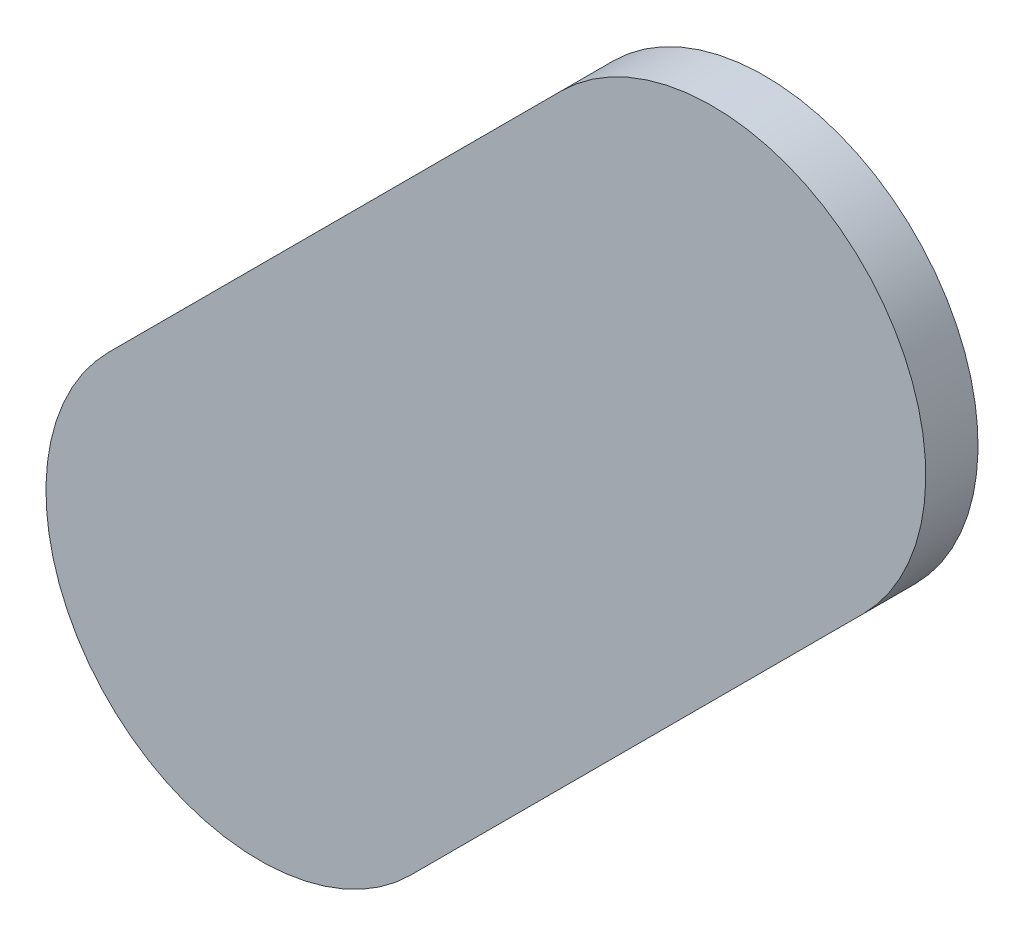
ISO-10303-21;
HEADER;
FILE_DESCRIPTION(('STEP AP214'),'2;1');
FILE_NAME('part.step','',(''),(''),'','','');
FILE_SCHEMA(('AUTOMOTIVE_DESIGN { 1 0 10303 214 1 1 1 1 }'));
ENDSEC;
DATA;
#1=APPLICATION_CONTEXT('core data for automotive mechanical design processes');
#2=APPLICATION_PROTOCOL_DEFINITION('international standard','automotive_design',2000,#1);
#3=PRODUCT_CONTEXT('',#1,'mechanical');
#4=PRODUCT('Part','Part','',(#3));
#5=PRODUCT_RELATED_PRODUCT_CATEGORY('part','',(#4));
#6=PRODUCT_DEFINITION_FORMATION('','',#4);
#7=PRODUCT_DEFINITION_CONTEXT('part definition',#1,'design');
#8=PRODUCT_DEFINITION('design','',#6,#7);
#9=PRODUCT_DEFINITION_SHAPE('','',#8);
#10=(LENGTH_UNIT() NAMED_UNIT(*) SI_UNIT(.MILLI.,.METRE.));
#11=(NAMED_UNIT(*) PLANE_ANGLE_UNIT() SI_UNIT($,.RADIAN.));
#12=(NAMED_UNIT(*) SI_UNIT($,.STERADIAN.) SOLID_ANGLE_UNIT());
#13=UNCERTAINTY_MEASURE_WITH_UNIT(LENGTH_MEASURE(1.E-05),#10,'distance_accuracy_value','');
#14=(GEOMETRIC_REPRESENTATION_CONTEXT(3) GLOBAL_UNCERTAINTY_ASSIGNED_CONTEXT((#13)) GLOBAL_UNIT_ASSIGNED_CONTEXT((#10,
#11,#12)) REPRESENTATION_CONTEXT('',''));
#15=CARTESIAN_POINT('',(0.,0.,0.));
#16=DIRECTION('',(0.,0.,1.));
#17=DIRECTION('',(1.,0.,0.));
#18=AXIS2_PLACEMENT_3D('',#15,#16,#17);
#19=CARTESIAN_POINT('',(7.89796542298,5.910197978031,0.79916));
#20=DIRECTION('',(0.,0.,1.));
#21=DIRECTION('',(1.,0.,0.));
#22=AXIS2_PLACEMENT_3D('',#19,#20,#21);
#23=PLANE('',#22);
#24=CARTESIAN_POINT('',(7.749472667,5.761705333,0.79916));
#25=DIRECTION('',(0.,0.,1.));
#26=DIRECTION('',(1.,0.,0.));
#27=AXIS2_PLACEMENT_3D('',#24,#25,#26);
#28=CIRCLE('',#27,0.139999667);
#29=CARTESIAN_POINT('',(7.84846798312215,5.66271065012204,0.79916));
#30=VERTEX_POINT('',#29);
#31=CARTESIAN_POINT('',(7.65047807216728,5.86070016596486,0.79916));
#32=VERTEX_POINT('',#31);
#33=EDGE_CURVE('E20',#30,#32,#28,.F.);
#34=ORIENTED_EDGE('',*,*,#33,.F.);
#35=DIRECTION('',(-0.707106660628037,-0.707106901745037,0.));
#36=VECTOR('',#35,1.);
#37=CARTESIAN_POINT('',(8.145452615866,5.959695384135,0.79916));
#38=LINE('',#37,#36);
#39=CARTESIAN_POINT('',(8.14545279105482,5.95969555932387,0.79916));
#40=VERTEX_POINT('',#39);
#41=EDGE_CURVE('E65',#30,#40,#38,.F.);
#42=ORIENTED_EDGE('',*,*,#41,.T.);
#43=CARTESIAN_POINT('',(8.046457667,6.058690434268,0.79916));
#44=DIRECTION('',(0.,0.,1.));
#45=DIRECTION('',(1.,0.,0.));
#46=AXIS2_PLACEMENT_3D('',#43,#44,#45);
#47=CIRCLE('',#46,0.14);
#48=CARTESIAN_POINT('',(7.94746264463338,6.15768531063353,0.79916));
#49=VERTEX_POINT('',#48);
#50=EDGE_CURVE('E57',#49,#40,#47,.F.);
#51=ORIENTED_EDGE('',*,*,#50,.F.);
#52=DIRECTION('',(0.707106099992719,0.707107462379719,0.));
#53=VECTOR('',#52,1.);
#54=CARTESIAN_POINT('',(7.6504782866,5.860700380398,0.79916));
#55=LINE('',#54,#53);
#56=EDGE_CURVE('E64',#49,#32,#55,.F.);
#57=ORIENTED_EDGE('',*,*,#56,.T.);
#58=EDGE_LOOP('',(#34,#42,#51,#57));
#59=FACE_BOUND('',#58,.T.);
#60=ADVANCED_FACE('F17',(#59),#23,.T.);
#61=CARTESIAN_POINT('',(8.145452615866,5.959695384135,0.76487));
#62=DIRECTION('',(-0.707106901745037,0.707106660628037,0.));
#63=DIRECTION('',(-0.707106660628037,-0.707106901745037,0.));
#64=AXIS2_PLACEMENT_3D('',#61,#62,#63);
#65=PLANE('',#64);
#66=DIRECTION('',(0.,0.,1.));
#67=VECTOR('',#66,1.);
#68=CARTESIAN_POINT('',(7.84846800000011,5.6627106669999,0.76487));
#69=LINE('',#68,#67);
#70=CARTESIAN_POINT('',(7.84846798312214,5.66271065012203,0.76487));
#71=VERTEX_POINT('',#70);
#72=EDGE_CURVE('E68',#71,#30,#69,.T.);
#73=ORIENTED_EDGE('',*,*,#72,.F.);
#74=DIRECTION('',(-0.707106660628131,-0.707106901744944,0.));
#75=VECTOR('',#74,1.);
#76=CARTESIAN_POINT('',(8.145452615866,5.959695384135,0.76487));
#77=LINE('',#76,#75);
#78=CARTESIAN_POINT('',(8.14545279105481,5.95969555932387,0.76487));
#79=VERTEX_POINT('',#78);
#80=EDGE_CURVE('E72',#79,#71,#77,.T.);
#81=ORIENTED_EDGE('',*,*,#80,.F.);
#82=DIRECTION('',(0.,0.,1.));
#83=VECTOR('',#82,1.);
#84=CARTESIAN_POINT('',(8.145452615866,5.959695384135,0.76487));
#85=LINE('',#84,#83);
#86=EDGE_CURVE('E60',#40,#79,#85,.F.);
#87=ORIENTED_EDGE('',*,*,#86,.F.);
#88=ORIENTED_EDGE('',*,*,#41,.F.);
#89=EDGE_LOOP('',(#73,#81,#87,#88));
#90=FACE_BOUND('',#89,.T.);
#91=ADVANCED_FACE('F70',(#90),#65,.F.);
#92=CARTESIAN_POINT('',(7.749472667,5.761705333,0.76487));
#93=DIRECTION('',(0.,0.,1.));
#94=DIRECTION('',(1.,0.,0.));
#95=AXIS2_PLACEMENT_3D('',#92,#93,#94);
#96=CYLINDRICAL_SURFACE('',#95,0.139999667);
#97=DIRECTION('',(0.,0.,1.));
#98=VECTOR('',#97,1.);
#99=CARTESIAN_POINT('',(7.6504782866,5.860700380398,0.76487));
#100=LINE('',#99,#98);
#101=CARTESIAN_POINT('',(7.65047807216729,5.86070016596488,0.76487));
#102=VERTEX_POINT('',#101);
#103=EDGE_CURVE('E77',#32,#102,#100,.F.);
#104=ORIENTED_EDGE('',*,*,#103,.T.);
#105=CARTESIAN_POINT('',(7.749473,5.761705565732,0.76487));
#106=DIRECTION('',(0.,0.,1.));
#107=DIRECTION('',(1.,0.,0.));
#108=AXIS2_PLACEMENT_3D('',#105,#106,#107);
#109=CIRCLE('',#108,0.14);
#110=EDGE_CURVE('E26',#71,#102,#109,.F.);
#111=ORIENTED_EDGE('',*,*,#110,.F.);
#112=ORIENTED_EDGE('',*,*,#72,.T.);
#113=ORIENTED_EDGE('',*,*,#33,.T.);
#114=EDGE_LOOP('',(#104,#111,#112,#113));
#115=FACE_BOUND('',#114,.T.);
#116=ADVANCED_FACE('F88',(#115),#96,.T.);
#117=CARTESIAN_POINT('',(7.6504782866,5.860700380398,0.76487));
#118=DIRECTION('',(0.707107462379719,-0.707106099992719,0.));
#119=DIRECTION('',(0.707106099992719,0.707107462379719,0.));
#120=AXIS2_PLACEMENT_3D('',#117,#118,#119);
#121=PLANE('',#120);
#122=DIRECTION('',(0.,0.,1.));
#123=VECTOR('',#122,1.);
#124=CARTESIAN_POINT('',(7.9474626669999,6.1576853330001,0.76487));
#125=LINE('',#124,#123);
#126=CARTESIAN_POINT('',(7.94746264463344,6.1576853106335,0.76487));
#127=VERTEX_POINT('',#126);
#128=EDGE_CURVE('E62',#127,#49,#125,.T.);
#129=ORIENTED_EDGE('',*,*,#128,.F.);
#130=DIRECTION('',(0.707106099992943,0.707107462379495,0.));
#131=VECTOR('',#130,1.);
#132=CARTESIAN_POINT('',(7.6504782866,5.860700380398,0.76487));
#133=LINE('',#132,#131);
#134=EDGE_CURVE('E11',#102,#127,#133,.T.);
#135=ORIENTED_EDGE('',*,*,#134,.F.);
#136=ORIENTED_EDGE('',*,*,#103,.F.);
#137=ORIENTED_EDGE('',*,*,#56,.F.);
#138=EDGE_LOOP('',(#129,#135,#136,#137));
#139=FACE_BOUND('',#138,.T.);
#140=ADVANCED_FACE('F96',(#139),#121,.F.);
#141=CARTESIAN_POINT('',(8.046457667,6.058690434268,0.76487));
#142=DIRECTION('',(0.,0.,1.));
#143=DIRECTION('',(1.,0.,0.));
#144=AXIS2_PLACEMENT_3D('',#141,#142,#143);
#145=CYLINDRICAL_SURFACE('',#144,0.14);
#146=CARTESIAN_POINT('',(8.046458,6.058690667,0.76487));
#147=DIRECTION('',(0.,0.,1.));
#148=DIRECTION('',(1.,0.,0.));
#149=AXIS2_PLACEMENT_3D('',#146,#147,#148);
#150=CIRCLE('',#149,0.14);
#151=EDGE_CURVE('E35',#127,#79,#150,.F.);
#152=ORIENTED_EDGE('',*,*,#151,.F.);
#153=ORIENTED_EDGE('',*,*,#128,.T.);
#154=ORIENTED_EDGE('',*,*,#50,.T.);
#155=ORIENTED_EDGE('',*,*,#86,.T.);
#156=EDGE_LOOP('',(#152,#153,#154,#155));
#157=FACE_BOUND('',#156,.T.);
#158=ADVANCED_FACE('F58',(#157),#145,.T.);
#159=CARTESIAN_POINT('',(7.89796542298,5.910197978031,0.76487));
#160=DIRECTION('',(0.,0.,-1.));
#161=DIRECTION('',(-1.,0.,0.));
#162=AXIS2_PLACEMENT_3D('',#159,#160,#161);
#163=PLANE('',#162);
#164=ORIENTED_EDGE('',*,*,#134,.T.);
#165=ORIENTED_EDGE('',*,*,#151,.T.);
#166=ORIENTED_EDGE('',*,*,#80,.T.);
#167=ORIENTED_EDGE('',*,*,#110,.T.);
#168=EDGE_LOOP('',(#164,#165,#166,#167));
#169=FACE_BOUND('',#168,.T.);
#170=ADVANCED_FACE('F89',(#169),#163,.T.);
#171=CLOSED_SHELL('',(#60,#91,#116,#140,#158,#170));
#172=MANIFOLD_SOLID_BREP('B1',#171);
#173=ADVANCED_BREP_SHAPE_REPRESENTATION('',(#18,#172),#14);
#174=SHAPE_DEFINITION_REPRESENTATION(#9,#173);
ENDSEC;
END-ISO-10303-21;
